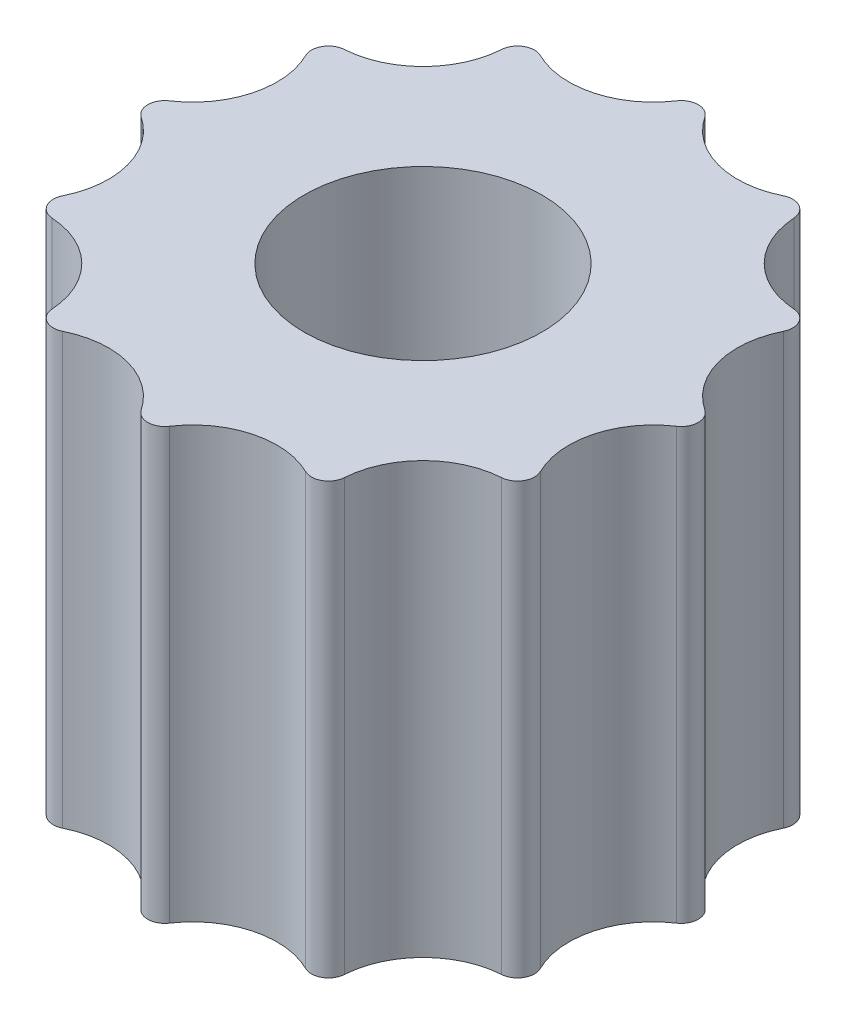
ISO-10303-21;
HEADER;
FILE_DESCRIPTION(('STEP AP214'),'2;1');
FILE_NAME('part.step','',(''),(''),'','','');
FILE_SCHEMA(('AUTOMOTIVE_DESIGN { 1 0 10303 214 1 1 1 1 }'));
ENDSEC;
DATA;
#1=APPLICATION_CONTEXT('core data for automotive mechanical design processes');
#2=APPLICATION_PROTOCOL_DEFINITION('international standard','automotive_design',2000,#1);
#3=PRODUCT_CONTEXT('',#1,'mechanical');
#4=PRODUCT('Part','Part','',(#3));
#5=PRODUCT_RELATED_PRODUCT_CATEGORY('part','',(#4));
#6=PRODUCT_DEFINITION_FORMATION('','',#4);
#7=PRODUCT_DEFINITION_CONTEXT('part definition',#1,'design');
#8=PRODUCT_DEFINITION('design','',#6,#7);
#9=PRODUCT_DEFINITION_SHAPE('','',#8);
#10=(LENGTH_UNIT() NAMED_UNIT(*) SI_UNIT(.MILLI.,.METRE.));
#11=(NAMED_UNIT(*) PLANE_ANGLE_UNIT() SI_UNIT($,.RADIAN.));
#12=(NAMED_UNIT(*) SI_UNIT($,.STERADIAN.) SOLID_ANGLE_UNIT());
#13=UNCERTAINTY_MEASURE_WITH_UNIT(LENGTH_MEASURE(1.E-05),#10,'distance_accuracy_value','');
#14=(GEOMETRIC_REPRESENTATION_CONTEXT(3) GLOBAL_UNCERTAINTY_ASSIGNED_CONTEXT((#13)) GLOBAL_UNIT_ASSIGNED_CONTEXT((#10,
#11,#12)) REPRESENTATION_CONTEXT('',''));
#15=CARTESIAN_POINT('',(0.,0.,0.));
#16=DIRECTION('',(0.,0.,1.));
#17=DIRECTION('',(1.,0.,0.));
#18=AXIS2_PLACEMENT_3D('',#15,#16,#17);
#19=CARTESIAN_POINT('',(-2.77703675058107,7.6,-4.80996874649239));
#20=DIRECTION('',(0.,1.,0.));
#21=DIRECTION('',(0.,0.,1.));
#22=AXIS2_PLACEMENT_3D('',#19,#20,#21);
#23=PLANE('',#22);
#24=CARTESIAN_POINT('',(5.55407350116214,7.6,-1.4882095093395));
#25=DIRECTION('',(0.,-1.,0.));
#26=DIRECTION('',(0.,0.,1.));
#27=AXIS2_PLACEMENT_3D('',#24,#25,#26);
#28=CIRCLE('',#27,1.48919155491039);
#29=CARTESIAN_POINT('',(4.72740990112526,7.6,-0.249533288694861));
#30=VERTEX_POINT('',#29);
#31=CARTESIAN_POINT('',(4.21882371282398,7.6,-2.14760278346301));
#32=VERTEX_POINT('',#31);
#33=EDGE_CURVE('E448',#30,#32,#28,.T.);
#34=ORIENTED_EDGE('',*,*,#33,.T.);
#35=CARTESIAN_POINT('',(3.94983552579015,7.6,-2.28043860406969));
#36=DIRECTION('',(0.,1.,0.));
#37=DIRECTION('',(0.,0.,1.));
#38=AXIS2_PLACEMENT_3D('',#35,#36,#37);
#39=CIRCLE('',#38,0.3);
#40=CARTESIAN_POINT('',(3.96929042412913,7.6,-2.57980711766225));
#41=VERTEX_POINT('',#40);
#42=EDGE_CURVE('E318',#32,#41,#39,.T.);
#43=ORIENTED_EDGE('',*,*,#42,.T.);
#44=CARTESIAN_POINT('',(4.06586399182265,7.6,-4.06586399182265));
#45=DIRECTION('',(0.,-1.,0.));
#46=DIRECTION('',(0.,0.,1.));
#47=AXIS2_PLACEMENT_3D('',#44,#45,#46);
#48=CIRCLE('',#47,1.48919155491039);
#49=CARTESIAN_POINT('',(2.57980711766224,7.6,-3.96929042412914));
#50=VERTEX_POINT('',#49);
#51=EDGE_CURVE('E223',#41,#50,#48,.T.);
#52=ORIENTED_EDGE('',*,*,#51,.T.);
#53=CARTESIAN_POINT('',(2.28043860406968,7.6,-3.94983552579015));
#54=DIRECTION('',(0.,1.,0.));
#55=DIRECTION('',(0.,0.,1.));
#56=AXIS2_PLACEMENT_3D('',#53,#54,#55);
#57=CIRCLE('',#56,0.3);
#58=CARTESIAN_POINT('',(2.14760278346301,7.6,-4.21882371282399));
#59=VERTEX_POINT('',#58);
#60=EDGE_CURVE('E286',#50,#59,#57,.T.);
#61=ORIENTED_EDGE('',*,*,#60,.T.);
#62=CARTESIAN_POINT('',(1.48820950933949,7.6,-5.55407350116214));
#63=DIRECTION('',(0.,-1.,0.));
#64=DIRECTION('',(0.,0.,1.));
#65=AXIS2_PLACEMENT_3D('',#62,#63,#64);
#66=CIRCLE('',#65,1.48919155491039);
#67=CARTESIAN_POINT('',(0.249533288694854,7.6,-4.72740990112526));
#68=VERTEX_POINT('',#67);
#69=EDGE_CURVE('E389',#59,#68,#66,.T.);
#70=ORIENTED_EDGE('',*,*,#69,.T.);
#71=CARTESIAN_POINT('',(0.,7.6,-4.56087720813937));
#72=DIRECTION('',(0.,1.,0.));
#73=DIRECTION('',(0.,0.,1.));
#74=AXIS2_PLACEMENT_3D('',#71,#72,#73);
#75=CIRCLE('',#74,0.3);
#76=CARTESIAN_POINT('',(-0.249533288694852,7.6,-4.72740990112526));
#77=VERTEX_POINT('',#76);
#78=EDGE_CURVE('E62',#68,#77,#75,.T.);
#79=ORIENTED_EDGE('',*,*,#78,.T.);
#80=CARTESIAN_POINT('',(-1.4882095093395,7.6,-5.55407350116214));
#81=DIRECTION('',(0.,-1.,0.));
#82=DIRECTION('',(0.,0.,1.));
#83=AXIS2_PLACEMENT_3D('',#80,#81,#82);
#84=CIRCLE('',#83,1.48919155491039);
#85=CARTESIAN_POINT('',(-2.14760278346302,7.6,-4.21882371282398));
#86=VERTEX_POINT('',#85);
#87=EDGE_CURVE('E248',#77,#86,#84,.T.);
#88=ORIENTED_EDGE('',*,*,#87,.T.);
#89=CARTESIAN_POINT('',(-2.28043860406969,7.6,-3.94983552579014));
#90=DIRECTION('',(0.,1.,0.));
#91=DIRECTION('',(0.,0.,1.));
#92=AXIS2_PLACEMENT_3D('',#89,#90,#91);
#93=CIRCLE('',#92,0.3);
#94=CARTESIAN_POINT('',(-2.57980711766225,7.6,-3.96929042412913));
#95=VERTEX_POINT('',#94);
#96=EDGE_CURVE('E291',#86,#95,#93,.T.);
#97=ORIENTED_EDGE('',*,*,#96,.T.);
#98=CARTESIAN_POINT('',(-4.06586399182265,7.6,-4.06586399182265));
#99=DIRECTION('',(0.,-1.,0.));
#100=DIRECTION('',(0.,0.,1.));
#101=AXIS2_PLACEMENT_3D('',#98,#99,#100);
#102=CIRCLE('',#101,1.48919155491039);
#103=CARTESIAN_POINT('',(-3.96929042412913,7.6,-2.57980711766225));
#104=VERTEX_POINT('',#103);
#105=EDGE_CURVE('E246',#95,#104,#102,.T.);
#106=ORIENTED_EDGE('',*,*,#105,.T.);
#107=CARTESIAN_POINT('',(-3.94983552579014,7.6,-2.28043860406969));
#108=DIRECTION('',(0.,1.,0.));
#109=DIRECTION('',(0.,0.,1.));
#110=AXIS2_PLACEMENT_3D('',#107,#108,#109);
#111=CIRCLE('',#110,0.3);
#112=CARTESIAN_POINT('',(-4.21882371282398,7.6,-2.14760278346301));
#113=VERTEX_POINT('',#112);
#114=EDGE_CURVE('E294',#104,#113,#111,.T.);
#115=ORIENTED_EDGE('',*,*,#114,.T.);
#116=CARTESIAN_POINT('',(-5.55407350116215,7.6,-1.48820950933949));
#117=DIRECTION('',(0.,-1.,0.));
#118=DIRECTION('',(0.,0.,1.));
#119=AXIS2_PLACEMENT_3D('',#116,#117,#118);
#120=CIRCLE('',#119,1.4891915549104);
#121=CARTESIAN_POINT('',(-4.72740990112526,7.6,-0.249533288694845));
#122=VERTEX_POINT('',#121);
#123=EDGE_CURVE('E478',#113,#122,#120,.T.);
#124=ORIENTED_EDGE('',*,*,#123,.T.);
#125=CARTESIAN_POINT('',(-4.56087720813938,7.6,0.));
#126=DIRECTION('',(0.,1.,0.));
#127=DIRECTION('',(0.,0.,1.));
#128=AXIS2_PLACEMENT_3D('',#125,#126,#127);
#129=CIRCLE('',#128,0.3);
#130=CARTESIAN_POINT('',(-4.72740990112526,7.6,0.249533288694862));
#131=VERTEX_POINT('',#130);
#132=EDGE_CURVE('E297',#122,#131,#129,.T.);
#133=ORIENTED_EDGE('',*,*,#132,.T.);
#134=CARTESIAN_POINT('',(-5.55407350116214,7.6,1.4882095093395));
#135=DIRECTION('',(0.,-1.,0.));
#136=DIRECTION('',(0.,0.,1.));
#137=AXIS2_PLACEMENT_3D('',#134,#135,#136);
#138=CIRCLE('',#137,1.48919155491039);
#139=CARTESIAN_POINT('',(-4.21882371282398,7.6,2.14760278346301));
#140=VERTEX_POINT('',#139);
#141=EDGE_CURVE('E474',#131,#140,#138,.T.);
#142=ORIENTED_EDGE('',*,*,#141,.T.);
#143=CARTESIAN_POINT('',(-3.94983552579014,7.6,2.28043860406969));
#144=DIRECTION('',(0.,1.,0.));
#145=DIRECTION('',(0.,0.,1.));
#146=AXIS2_PLACEMENT_3D('',#143,#144,#145);
#147=CIRCLE('',#146,0.3);
#148=CARTESIAN_POINT('',(-3.96929042412913,7.6,2.57980711766225));
#149=VERTEX_POINT('',#148);
#150=EDGE_CURVE('E300',#140,#149,#147,.T.);
#151=ORIENTED_EDGE('',*,*,#150,.T.);
#152=CARTESIAN_POINT('',(-4.06586399182265,7.6,4.06586399182265));
#153=DIRECTION('',(0.,-1.,0.));
#154=DIRECTION('',(0.,0.,1.));
#155=AXIS2_PLACEMENT_3D('',#152,#153,#154);
#156=CIRCLE('',#155,1.48919155491039);
#157=CARTESIAN_POINT('',(-2.57980711766224,7.6,3.96929042412913));
#158=VERTEX_POINT('',#157);
#159=EDGE_CURVE('E470',#149,#158,#156,.T.);
#160=ORIENTED_EDGE('',*,*,#159,.T.);
#161=CARTESIAN_POINT('',(-2.28043860406968,7.6,3.94983552579015));
#162=DIRECTION('',(0.,1.,0.));
#163=DIRECTION('',(0.,0.,1.));
#164=AXIS2_PLACEMENT_3D('',#161,#162,#163);
#165=CIRCLE('',#164,0.3);
#166=CARTESIAN_POINT('',(-2.14760278346301,7.6,4.21882371282399));
#167=VERTEX_POINT('',#166);
#168=EDGE_CURVE('E303',#158,#167,#165,.T.);
#169=ORIENTED_EDGE('',*,*,#168,.T.);
#170=CARTESIAN_POINT('',(-1.48820950933949,7.6,5.55407350116214));
#171=DIRECTION('',(0.,-1.,0.));
#172=DIRECTION('',(0.,0.,1.));
#173=AXIS2_PLACEMENT_3D('',#170,#171,#172);
#174=CIRCLE('',#173,1.48919155491039);
#175=CARTESIAN_POINT('',(-0.249533288694853,7.6,4.72740990112526));
#176=VERTEX_POINT('',#175);
#177=EDGE_CURVE('E466',#167,#176,#174,.T.);
#178=ORIENTED_EDGE('',*,*,#177,.T.);
#179=CARTESIAN_POINT('',(0.,7.6,4.56087720813937));
#180=DIRECTION('',(0.,1.,0.));
#181=DIRECTION('',(0.,0.,1.));
#182=AXIS2_PLACEMENT_3D('',#179,#180,#181);
#183=CIRCLE('',#182,0.3);
#184=CARTESIAN_POINT('',(0.249533288694854,7.6,4.72740990112526));
#185=VERTEX_POINT('',#184);
#186=EDGE_CURVE('E306',#176,#185,#183,.T.);
#187=ORIENTED_EDGE('',*,*,#186,.T.);
#188=CARTESIAN_POINT('',(1.4882095093395,7.6,5.55407350116214));
#189=DIRECTION('',(0.,-1.,0.));
#190=DIRECTION('',(0.,0.,1.));
#191=AXIS2_PLACEMENT_3D('',#188,#189,#190);
#192=CIRCLE('',#191,1.48919155491039);
#193=CARTESIAN_POINT('',(2.14760278346302,7.6,4.21882371282398));
#194=VERTEX_POINT('',#193);
#195=EDGE_CURVE('E462',#185,#194,#192,.T.);
#196=ORIENTED_EDGE('',*,*,#195,.T.);
#197=CARTESIAN_POINT('',(2.28043860406969,7.6,3.94983552579014));
#198=DIRECTION('',(0.,1.,0.));
#199=DIRECTION('',(0.,0.,1.));
#200=AXIS2_PLACEMENT_3D('',#197,#198,#199);
#201=CIRCLE('',#200,0.3);
#202=CARTESIAN_POINT('',(2.57980711766225,7.6,3.96929042412913));
#203=VERTEX_POINT('',#202);
#204=EDGE_CURVE('E309',#194,#203,#201,.T.);
#205=ORIENTED_EDGE('',*,*,#204,.T.);
#206=CARTESIAN_POINT('',(4.06586399182265,7.6,4.06586399182264));
#207=DIRECTION('',(0.,-1.,0.));
#208=DIRECTION('',(0.,0.,1.));
#209=AXIS2_PLACEMENT_3D('',#206,#207,#208);
#210=CIRCLE('',#209,1.48919155491039);
#211=CARTESIAN_POINT('',(3.96929042412913,7.6,2.57980711766225));
#212=VERTEX_POINT('',#211);
#213=EDGE_CURVE('E456',#203,#212,#210,.T.);
#214=ORIENTED_EDGE('',*,*,#213,.T.);
#215=CARTESIAN_POINT('',(3.94983552579014,7.6,2.28043860406969));
#216=DIRECTION('',(0.,1.,0.));
#217=DIRECTION('',(0.,0.,1.));
#218=AXIS2_PLACEMENT_3D('',#215,#216,#217);
#219=CIRCLE('',#218,0.3);
#220=CARTESIAN_POINT('',(4.21882371282398,7.6,2.14760278346301));
#221=VERTEX_POINT('',#220);
#222=EDGE_CURVE('E312',#212,#221,#219,.T.);
#223=ORIENTED_EDGE('',*,*,#222,.T.);
#224=CARTESIAN_POINT('',(5.55407350116214,7.6,1.48820950933949));
#225=DIRECTION('',(0.,-1.,0.));
#226=DIRECTION('',(0.,0.,1.));
#227=AXIS2_PLACEMENT_3D('',#224,#225,#226);
#228=CIRCLE('',#227,1.48919155491039);
#229=CARTESIAN_POINT('',(4.72740990112526,7.6,0.249533288694847));
#230=VERTEX_POINT('',#229);
#231=EDGE_CURVE('E449',#221,#230,#228,.T.);
#232=ORIENTED_EDGE('',*,*,#231,.T.);
#233=CARTESIAN_POINT('',(4.56087720813938,7.6,0.));
#234=DIRECTION('',(0.,1.,0.));
#235=DIRECTION('',(0.,0.,1.));
#236=AXIS2_PLACEMENT_3D('',#233,#234,#235);
#237=CIRCLE('',#236,0.3);
#238=EDGE_CURVE('E315',#230,#30,#237,.T.);
#239=ORIENTED_EDGE('',*,*,#238,.T.);
#240=EDGE_LOOP('',(#34,#43,#52,#61,#70,#79,#88,#97,#106,#115,#124,#133,#142,#151,#160,#169,#178,
#187,#196,#205,#214,#223,#232,#239));
#241=FACE_BOUND('',#240,.T.);
#242=CARTESIAN_POINT('',(0.,7.6,0.));
#243=DIRECTION('',(0.,1.,0.));
#244=DIRECTION('',(0.,0.,1.));
#245=AXIS2_PLACEMENT_3D('',#242,#243,#244);
#246=CIRCLE('',#245,2.1);
#247=CARTESIAN_POINT('',(0.,7.6,2.1));
#248=VERTEX_POINT('',#247);
#249=EDGE_CURVE('E409',#248,#248,#246,.T.);
#250=ORIENTED_EDGE('',*,*,#249,.F.);
#251=EDGE_LOOP('',(#250));
#252=FACE_BOUND('',#251,.T.);
#253=ADVANCED_FACE('F39',(#241,#252),#23,.T.);
#254=CARTESIAN_POINT('',(-2.77703675058107,0.,-4.80996874649239));
#255=DIRECTION('',(0.,1.,0.));
#256=DIRECTION('',(0.,0.,1.));
#257=AXIS2_PLACEMENT_3D('',#254,#255,#256);
#258=PLANE('',#257);
#259=CARTESIAN_POINT('',(4.06586399182265,0.,-4.06586399182265));
#260=DIRECTION('',(0.,-1.,0.));
#261=DIRECTION('',(0.,0.,1.));
#262=AXIS2_PLACEMENT_3D('',#259,#260,#261);
#263=CIRCLE('',#262,1.48919155491039);
#264=CARTESIAN_POINT('',(3.96929042412913,0.,-2.57980711766225));
#265=VERTEX_POINT('',#264);
#266=CARTESIAN_POINT('',(2.57980711766224,0.,-3.96929042412914));
#267=VERTEX_POINT('',#266);
#268=EDGE_CURVE('E220',#265,#267,#263,.T.);
#269=ORIENTED_EDGE('',*,*,#268,.F.);
#270=CARTESIAN_POINT('',(3.94983552579015,0.,-2.28043860406969));
#271=DIRECTION('',(0.,1.,0.));
#272=DIRECTION('',(0.,0.,1.));
#273=AXIS2_PLACEMENT_3D('',#270,#271,#272);
#274=CIRCLE('',#273,0.3);
#275=CARTESIAN_POINT('',(4.21882371282398,0.,-2.14760278346301));
#276=VERTEX_POINT('',#275);
#277=EDGE_CURVE('E202',#265,#276,#274,.F.);
#278=ORIENTED_EDGE('',*,*,#277,.T.);
#279=CARTESIAN_POINT('',(5.55407350116214,0.,-1.4882095093395));
#280=DIRECTION('',(0.,-1.,0.));
#281=DIRECTION('',(0.,0.,1.));
#282=AXIS2_PLACEMENT_3D('',#279,#280,#281);
#283=CIRCLE('',#282,1.48919155491039);
#284=CARTESIAN_POINT('',(4.72740990112526,0.,-0.249533288694861));
#285=VERTEX_POINT('',#284);
#286=EDGE_CURVE('E233',#285,#276,#283,.T.);
#287=ORIENTED_EDGE('',*,*,#286,.F.);
#288=CARTESIAN_POINT('',(4.56087720813938,0.,0.));
#289=DIRECTION('',(0.,1.,0.));
#290=DIRECTION('',(0.,0.,1.));
#291=AXIS2_PLACEMENT_3D('',#288,#289,#290);
#292=CIRCLE('',#291,0.3);
#293=CARTESIAN_POINT('',(4.72740990112526,0.,0.249533288694847));
#294=VERTEX_POINT('',#293);
#295=EDGE_CURVE('E214',#285,#294,#292,.F.);
#296=ORIENTED_EDGE('',*,*,#295,.T.);
#297=CARTESIAN_POINT('',(5.55407350116214,0.,1.48820950933949));
#298=DIRECTION('',(0.,-1.,0.));
#299=DIRECTION('',(0.,0.,1.));
#300=AXIS2_PLACEMENT_3D('',#297,#298,#299);
#301=CIRCLE('',#300,1.48919155491039);
#302=CARTESIAN_POINT('',(4.21882371282398,0.,2.14760278346301));
#303=VERTEX_POINT('',#302);
#304=EDGE_CURVE('E240',#303,#294,#301,.T.);
#305=ORIENTED_EDGE('',*,*,#304,.F.);
#306=CARTESIAN_POINT('',(3.94983552579014,0.,2.28043860406969));
#307=DIRECTION('',(0.,1.,0.));
#308=DIRECTION('',(0.,0.,1.));
#309=AXIS2_PLACEMENT_3D('',#306,#307,#308);
#310=CIRCLE('',#309,0.3);
#311=CARTESIAN_POINT('',(3.96929042412913,0.,2.57980711766225));
#312=VERTEX_POINT('',#311);
#313=EDGE_CURVE('E276',#303,#312,#310,.F.);
#314=ORIENTED_EDGE('',*,*,#313,.T.);
#315=CARTESIAN_POINT('',(4.06586399182265,0.,4.06586399182264));
#316=DIRECTION('',(0.,-1.,0.));
#317=DIRECTION('',(0.,0.,1.));
#318=AXIS2_PLACEMENT_3D('',#315,#316,#317);
#319=CIRCLE('',#318,1.48919155491039);
#320=CARTESIAN_POINT('',(2.57980711766225,0.,3.96929042412913));
#321=VERTEX_POINT('',#320);
#322=EDGE_CURVE('E429',#321,#312,#319,.T.);
#323=ORIENTED_EDGE('',*,*,#322,.F.);
#324=CARTESIAN_POINT('',(2.28043860406969,0.,3.94983552579014));
#325=DIRECTION('',(0.,1.,0.));
#326=DIRECTION('',(0.,0.,1.));
#327=AXIS2_PLACEMENT_3D('',#324,#325,#326);
#328=CIRCLE('',#327,0.3);
#329=CARTESIAN_POINT('',(2.14760278346302,0.,4.21882371282398));
#330=VERTEX_POINT('',#329);
#331=EDGE_CURVE('E273',#321,#330,#328,.F.);
#332=ORIENTED_EDGE('',*,*,#331,.T.);
#333=CARTESIAN_POINT('',(1.4882095093395,0.,5.55407350116214));
#334=DIRECTION('',(0.,-1.,0.));
#335=DIRECTION('',(0.,0.,1.));
#336=AXIS2_PLACEMENT_3D('',#333,#334,#335);
#337=CIRCLE('',#336,1.48919155491039);
#338=CARTESIAN_POINT('',(0.249533288694854,0.,4.72740990112526));
#339=VERTEX_POINT('',#338);
#340=EDGE_CURVE('E425',#339,#330,#337,.T.);
#341=ORIENTED_EDGE('',*,*,#340,.F.);
#342=CARTESIAN_POINT('',(0.,0.,4.56087720813937));
#343=DIRECTION('',(0.,1.,0.));
#344=DIRECTION('',(0.,0.,1.));
#345=AXIS2_PLACEMENT_3D('',#342,#343,#344);
#346=CIRCLE('',#345,0.3);
#347=CARTESIAN_POINT('',(-0.249533288694853,0.,4.72740990112526));
#348=VERTEX_POINT('',#347);
#349=EDGE_CURVE('E270',#339,#348,#346,.F.);
#350=ORIENTED_EDGE('',*,*,#349,.T.);
#351=CARTESIAN_POINT('',(-1.48820950933949,0.,5.55407350116214));
#352=DIRECTION('',(0.,-1.,0.));
#353=DIRECTION('',(0.,0.,1.));
#354=AXIS2_PLACEMENT_3D('',#351,#352,#353);
#355=CIRCLE('',#354,1.48919155491039);
#356=CARTESIAN_POINT('',(-2.14760278346301,0.,4.21882371282399));
#357=VERTEX_POINT('',#356);
#358=EDGE_CURVE('E421',#357,#348,#355,.T.);
#359=ORIENTED_EDGE('',*,*,#358,.F.);
#360=CARTESIAN_POINT('',(-2.28043860406968,0.,3.94983552579015));
#361=DIRECTION('',(0.,1.,0.));
#362=DIRECTION('',(0.,0.,1.));
#363=AXIS2_PLACEMENT_3D('',#360,#361,#362);
#364=CIRCLE('',#363,0.3);
#365=CARTESIAN_POINT('',(-2.57980711766224,0.,3.96929042412913));
#366=VERTEX_POINT('',#365);
#367=EDGE_CURVE('E267',#357,#366,#364,.F.);
#368=ORIENTED_EDGE('',*,*,#367,.T.);
#369=CARTESIAN_POINT('',(-4.06586399182265,0.,4.06586399182265));
#370=DIRECTION('',(0.,-1.,0.));
#371=DIRECTION('',(0.,0.,1.));
#372=AXIS2_PLACEMENT_3D('',#369,#370,#371);
#373=CIRCLE('',#372,1.48919155491039);
#374=CARTESIAN_POINT('',(-3.96929042412913,0.,2.57980711766225));
#375=VERTEX_POINT('',#374);
#376=EDGE_CURVE('E417',#375,#366,#373,.T.);
#377=ORIENTED_EDGE('',*,*,#376,.F.);
#378=CARTESIAN_POINT('',(-3.94983552579014,0.,2.28043860406969));
#379=DIRECTION('',(0.,1.,0.));
#380=DIRECTION('',(0.,0.,1.));
#381=AXIS2_PLACEMENT_3D('',#378,#379,#380);
#382=CIRCLE('',#381,0.3);
#383=CARTESIAN_POINT('',(-4.21882371282398,0.,2.14760278346301));
#384=VERTEX_POINT('',#383);
#385=EDGE_CURVE('E264',#375,#384,#382,.F.);
#386=ORIENTED_EDGE('',*,*,#385,.T.);
#387=CARTESIAN_POINT('',(-5.55407350116214,0.,1.4882095093395));
#388=DIRECTION('',(0.,-1.,0.));
#389=DIRECTION('',(0.,0.,1.));
#390=AXIS2_PLACEMENT_3D('',#387,#388,#389);
#391=CIRCLE('',#390,1.48919155491039);
#392=CARTESIAN_POINT('',(-4.72740990112526,0.,0.249533288694862));
#393=VERTEX_POINT('',#392);
#394=EDGE_CURVE('E413',#393,#384,#391,.T.);
#395=ORIENTED_EDGE('',*,*,#394,.F.);
#396=CARTESIAN_POINT('',(-4.56087720813938,0.,0.));
#397=DIRECTION('',(0.,1.,0.));
#398=DIRECTION('',(0.,0.,1.));
#399=AXIS2_PLACEMENT_3D('',#396,#397,#398);
#400=CIRCLE('',#399,0.3);
#401=CARTESIAN_POINT('',(-4.72740990112526,0.,-0.249533288694845));
#402=VERTEX_POINT('',#401);
#403=EDGE_CURVE('E261',#393,#402,#400,.F.);
#404=ORIENTED_EDGE('',*,*,#403,.T.);
#405=CARTESIAN_POINT('',(-5.55407350116215,0.,-1.48820950933949));
#406=DIRECTION('',(0.,-1.,0.));
#407=DIRECTION('',(0.,0.,1.));
#408=AXIS2_PLACEMENT_3D('',#405,#406,#407);
#409=CIRCLE('',#408,1.4891915549104);
#410=CARTESIAN_POINT('',(-4.21882371282398,0.,-2.14760278346301));
#411=VERTEX_POINT('',#410);
#412=EDGE_CURVE('E408',#411,#402,#409,.T.);
#413=ORIENTED_EDGE('',*,*,#412,.F.);
#414=CARTESIAN_POINT('',(-3.94983552579014,0.,-2.28043860406969));
#415=DIRECTION('',(0.,1.,0.));
#416=DIRECTION('',(0.,0.,1.));
#417=AXIS2_PLACEMENT_3D('',#414,#415,#416);
#418=CIRCLE('',#417,0.3);
#419=CARTESIAN_POINT('',(-3.96929042412913,0.,-2.57980711766225));
#420=VERTEX_POINT('',#419);
#421=EDGE_CURVE('E258',#411,#420,#418,.F.);
#422=ORIENTED_EDGE('',*,*,#421,.T.);
#423=CARTESIAN_POINT('',(-4.06586399182265,0.,-4.06586399182265));
#424=DIRECTION('',(0.,-1.,0.));
#425=DIRECTION('',(0.,0.,1.));
#426=AXIS2_PLACEMENT_3D('',#423,#424,#425);
#427=CIRCLE('',#426,1.48919155491039);
#428=CARTESIAN_POINT('',(-2.57980711766225,0.,-3.96929042412913));
#429=VERTEX_POINT('',#428);
#430=EDGE_CURVE('E404',#429,#420,#427,.T.);
#431=ORIENTED_EDGE('',*,*,#430,.F.);
#432=CARTESIAN_POINT('',(-2.28043860406969,0.,-3.94983552579014));
#433=DIRECTION('',(0.,1.,0.));
#434=DIRECTION('',(0.,0.,1.));
#435=AXIS2_PLACEMENT_3D('',#432,#433,#434);
#436=CIRCLE('',#435,0.3);
#437=CARTESIAN_POINT('',(-2.14760278346302,0.,-4.21882371282398));
#438=VERTEX_POINT('',#437);
#439=EDGE_CURVE('E255',#429,#438,#436,.F.);
#440=ORIENTED_EDGE('',*,*,#439,.T.);
#441=CARTESIAN_POINT('',(-1.4882095093395,0.,-5.55407350116214));
#442=DIRECTION('',(0.,-1.,0.));
#443=DIRECTION('',(0.,0.,1.));
#444=AXIS2_PLACEMENT_3D('',#441,#442,#443);
#445=CIRCLE('',#444,1.48919155491039);
#446=CARTESIAN_POINT('',(-0.249533288694852,0.,-4.72740990112526));
#447=VERTEX_POINT('',#446);
#448=EDGE_CURVE('E238',#447,#438,#445,.T.);
#449=ORIENTED_EDGE('',*,*,#448,.F.);
#450=CARTESIAN_POINT('',(0.,0.,-4.56087720813937));
#451=DIRECTION('',(0.,1.,0.));
#452=DIRECTION('',(0.,0.,1.));
#453=AXIS2_PLACEMENT_3D('',#450,#451,#452);
#454=CIRCLE('',#453,0.3);
#455=CARTESIAN_POINT('',(0.249533288694854,0.,-4.72740990112526));
#456=VERTEX_POINT('',#455);
#457=EDGE_CURVE('E252',#447,#456,#454,.F.);
#458=ORIENTED_EDGE('',*,*,#457,.T.);
#459=CARTESIAN_POINT('',(1.48820950933949,0.,-5.55407350116214));
#460=DIRECTION('',(0.,-1.,0.));
#461=DIRECTION('',(0.,0.,1.));
#462=AXIS2_PLACEMENT_3D('',#459,#460,#461);
#463=CIRCLE('',#462,1.48919155491039);
#464=CARTESIAN_POINT('',(2.14760278346301,0.,-4.21882371282399));
#465=VERTEX_POINT('',#464);
#466=EDGE_CURVE('E232',#465,#456,#463,.T.);
#467=ORIENTED_EDGE('',*,*,#466,.F.);
#468=CARTESIAN_POINT('',(2.28043860406968,0.,-3.94983552579015));
#469=DIRECTION('',(0.,1.,0.));
#470=DIRECTION('',(0.,0.,1.));
#471=AXIS2_PLACEMENT_3D('',#468,#469,#470);
#472=CIRCLE('',#471,0.3);
#473=EDGE_CURVE('E225',#465,#267,#472,.F.);
#474=ORIENTED_EDGE('',*,*,#473,.T.);
#475=EDGE_LOOP('',(#269,#278,#287,#296,#305,#314,#323,#332,#341,#350,#359,#368,#377,#386,#395,
#404,#413,#422,#431,#440,#449,#458,#467,#474));
#476=FACE_BOUND('',#475,.T.);
#477=CARTESIAN_POINT('',(0.,0.,0.));
#478=DIRECTION('',(0.,1.,0.));
#479=DIRECTION('',(0.,0.,1.));
#480=AXIS2_PLACEMENT_3D('',#477,#478,#479);
#481=CIRCLE('',#480,2.1);
#482=CARTESIAN_POINT('',(0.,0.,2.1));
#483=VERTEX_POINT('',#482);
#484=EDGE_CURVE('E485',#483,#483,#481,.T.);
#485=ORIENTED_EDGE('',*,*,#484,.T.);
#486=EDGE_LOOP('',(#485));
#487=FACE_BOUND('',#486,.T.);
#488=ADVANCED_FACE('F228',(#476,#487),#258,.F.);
#489=CARTESIAN_POINT('',(-4.06586399182265,7.6,-4.06586399182265));
#490=DIRECTION('',(0.,-1.,0.));
#491=DIRECTION('',(0.,0.,-1.));
#492=AXIS2_PLACEMENT_3D('',#489,#490,#491);
#493=CYLINDRICAL_SURFACE('',#492,1.48919155491039);
#494=ORIENTED_EDGE('',*,*,#430,.T.);
#495=DIRECTION('',(0.,-1.,0.));
#496=VECTOR('',#495,1.);
#497=CARTESIAN_POINT('',(-3.96929042412913,7.6,-2.57980711766225));
#498=LINE('',#497,#496);
#499=EDGE_CURVE('E374',#420,#104,#498,.F.);
#500=ORIENTED_EDGE('',*,*,#499,.T.);
#501=ORIENTED_EDGE('',*,*,#105,.F.);
#502=DIRECTION('',(0.,-1.,0.));
#503=VECTOR('',#502,1.);
#504=CARTESIAN_POINT('',(-2.57980711766225,7.6,-3.96929042412913));
#505=LINE('',#504,#503);
#506=EDGE_CURVE('E370',#95,#429,#505,.T.);
#507=ORIENTED_EDGE('',*,*,#506,.T.);
#508=EDGE_LOOP('',(#494,#500,#501,#507));
#509=FACE_BOUND('',#508,.T.);
#510=ADVANCED_FACE('F500',(#509),#493,.F.);
#511=CARTESIAN_POINT('',(-5.55407350116215,7.6,-1.48820950933949));
#512=DIRECTION('',(0.,-1.,0.));
#513=DIRECTION('',(0.,0.,-1.));
#514=AXIS2_PLACEMENT_3D('',#511,#512,#513);
#515=CYLINDRICAL_SURFACE('',#514,1.4891915549104);
#516=ORIENTED_EDGE('',*,*,#412,.T.);
#517=DIRECTION('',(0.,-1.,0.));
#518=VECTOR('',#517,1.);
#519=CARTESIAN_POINT('',(-4.72740990112526,7.6,-0.249533288694845));
#520=LINE('',#519,#518);
#521=EDGE_CURVE('E367',#402,#122,#520,.F.);
#522=ORIENTED_EDGE('',*,*,#521,.T.);
#523=ORIENTED_EDGE('',*,*,#123,.F.);
#524=DIRECTION('',(0.,-1.,0.));
#525=VECTOR('',#524,1.);
#526=CARTESIAN_POINT('',(-4.21882371282398,7.6,-2.14760278346301));
#527=LINE('',#526,#525);
#528=EDGE_CURVE('E363',#113,#411,#527,.T.);
#529=ORIENTED_EDGE('',*,*,#528,.T.);
#530=EDGE_LOOP('',(#516,#522,#523,#529));
#531=FACE_BOUND('',#530,.T.);
#532=ADVANCED_FACE('F533',(#531),#515,.F.);
#533=CARTESIAN_POINT('',(-5.55407350116214,7.6,1.4882095093395));
#534=DIRECTION('',(0.,-1.,0.));
#535=DIRECTION('',(0.,0.,-1.));
#536=AXIS2_PLACEMENT_3D('',#533,#534,#535);
#537=CYLINDRICAL_SURFACE('',#536,1.48919155491039);
#538=ORIENTED_EDGE('',*,*,#394,.T.);
#539=DIRECTION('',(0.,-1.,0.));
#540=VECTOR('',#539,1.);
#541=CARTESIAN_POINT('',(-4.21882371282398,7.6,2.14760278346301));
#542=LINE('',#541,#540);
#543=EDGE_CURVE('E360',#384,#140,#542,.F.);
#544=ORIENTED_EDGE('',*,*,#543,.T.);
#545=ORIENTED_EDGE('',*,*,#141,.F.);
#546=DIRECTION('',(0.,-1.,0.));
#547=VECTOR('',#546,1.);
#548=CARTESIAN_POINT('',(-4.72740990112526,7.6,0.249533288694862));
#549=LINE('',#548,#547);
#550=EDGE_CURVE('E356',#131,#393,#549,.T.);
#551=ORIENTED_EDGE('',*,*,#550,.T.);
#552=EDGE_LOOP('',(#538,#544,#545,#551));
#553=FACE_BOUND('',#552,.T.);
#554=ADVANCED_FACE('F529',(#553),#537,.F.);
#555=CARTESIAN_POINT('',(-4.06586399182265,7.6,4.06586399182265));
#556=DIRECTION('',(0.,-1.,0.));
#557=DIRECTION('',(0.,0.,-1.));
#558=AXIS2_PLACEMENT_3D('',#555,#556,#557);
#559=CYLINDRICAL_SURFACE('',#558,1.48919155491039);
#560=ORIENTED_EDGE('',*,*,#376,.T.);
#561=DIRECTION('',(0.,-1.,0.));
#562=VECTOR('',#561,1.);
#563=CARTESIAN_POINT('',(-2.57980711766224,7.6,3.96929042412913));
#564=LINE('',#563,#562);
#565=EDGE_CURVE('E353',#366,#158,#564,.F.);
#566=ORIENTED_EDGE('',*,*,#565,.T.);
#567=ORIENTED_EDGE('',*,*,#159,.F.);
#568=DIRECTION('',(0.,-1.,0.));
#569=VECTOR('',#568,1.);
#570=CARTESIAN_POINT('',(-3.96929042412913,7.6,2.57980711766225));
#571=LINE('',#570,#569);
#572=EDGE_CURVE('E349',#149,#375,#571,.T.);
#573=ORIENTED_EDGE('',*,*,#572,.T.);
#574=EDGE_LOOP('',(#560,#566,#567,#573));
#575=FACE_BOUND('',#574,.T.);
#576=ADVANCED_FACE('F525',(#575),#559,.F.);
#577=CARTESIAN_POINT('',(-1.48820950933949,7.6,5.55407350116214));
#578=DIRECTION('',(0.,-1.,0.));
#579=DIRECTION('',(0.,0.,-1.));
#580=AXIS2_PLACEMENT_3D('',#577,#578,#579);
#581=CYLINDRICAL_SURFACE('',#580,1.48919155491039);
#582=ORIENTED_EDGE('',*,*,#358,.T.);
#583=DIRECTION('',(0.,-1.,0.));
#584=VECTOR('',#583,1.);
#585=CARTESIAN_POINT('',(-0.249533288694853,7.6,4.72740990112526));
#586=LINE('',#585,#584);
#587=EDGE_CURVE('E346',#348,#176,#586,.F.);
#588=ORIENTED_EDGE('',*,*,#587,.T.);
#589=ORIENTED_EDGE('',*,*,#177,.F.);
#590=DIRECTION('',(0.,-1.,0.));
#591=VECTOR('',#590,1.);
#592=CARTESIAN_POINT('',(-2.14760278346301,7.6,4.21882371282399));
#593=LINE('',#592,#591);
#594=EDGE_CURVE('E342',#167,#357,#593,.T.);
#595=ORIENTED_EDGE('',*,*,#594,.T.);
#596=EDGE_LOOP('',(#582,#588,#589,#595));
#597=FACE_BOUND('',#596,.T.);
#598=ADVANCED_FACE('F521',(#597),#581,.F.);
#599=CARTESIAN_POINT('',(1.4882095093395,7.6,5.55407350116214));
#600=DIRECTION('',(0.,-1.,0.));
#601=DIRECTION('',(0.,0.,-1.));
#602=AXIS2_PLACEMENT_3D('',#599,#600,#601);
#603=CYLINDRICAL_SURFACE('',#602,1.48919155491039);
#604=ORIENTED_EDGE('',*,*,#340,.T.);
#605=DIRECTION('',(0.,-1.,0.));
#606=VECTOR('',#605,1.);
#607=CARTESIAN_POINT('',(2.14760278346302,7.6,4.21882371282398));
#608=LINE('',#607,#606);
#609=EDGE_CURVE('E339',#330,#194,#608,.F.);
#610=ORIENTED_EDGE('',*,*,#609,.T.);
#611=ORIENTED_EDGE('',*,*,#195,.F.);
#612=DIRECTION('',(0.,-1.,0.));
#613=VECTOR('',#612,1.);
#614=CARTESIAN_POINT('',(0.249533288694853,7.6,4.72740990112526));
#615=LINE('',#614,#613);
#616=EDGE_CURVE('E335',#185,#339,#615,.T.);
#617=ORIENTED_EDGE('',*,*,#616,.T.);
#618=EDGE_LOOP('',(#604,#610,#611,#617));
#619=FACE_BOUND('',#618,.T.);
#620=ADVANCED_FACE('F517',(#619),#603,.F.);
#621=CARTESIAN_POINT('',(4.06586399182265,7.6,4.06586399182264));
#622=DIRECTION('',(0.,-1.,0.));
#623=DIRECTION('',(0.,0.,-1.));
#624=AXIS2_PLACEMENT_3D('',#621,#622,#623);
#625=CYLINDRICAL_SURFACE('',#624,1.48919155491039);
#626=ORIENTED_EDGE('',*,*,#322,.T.);
#627=DIRECTION('',(0.,-1.,0.));
#628=VECTOR('',#627,1.);
#629=CARTESIAN_POINT('',(3.96929042412913,7.6,2.57980711766225));
#630=LINE('',#629,#628);
#631=EDGE_CURVE('E332',#312,#212,#630,.F.);
#632=ORIENTED_EDGE('',*,*,#631,.T.);
#633=ORIENTED_EDGE('',*,*,#213,.F.);
#634=DIRECTION('',(0.,-1.,0.));
#635=VECTOR('',#634,1.);
#636=CARTESIAN_POINT('',(2.57980711766225,7.6,3.96929042412913));
#637=LINE('',#636,#635);
#638=EDGE_CURVE('E328',#203,#321,#637,.T.);
#639=ORIENTED_EDGE('',*,*,#638,.T.);
#640=EDGE_LOOP('',(#626,#632,#633,#639));
#641=FACE_BOUND('',#640,.T.);
#642=ADVANCED_FACE('F514',(#641),#625,.F.);
#643=CARTESIAN_POINT('',(5.55407350116214,7.6,1.48820950933949));
#644=DIRECTION('',(0.,-1.,0.));
#645=DIRECTION('',(0.,0.,-1.));
#646=AXIS2_PLACEMENT_3D('',#643,#644,#645);
#647=CYLINDRICAL_SURFACE('',#646,1.48919155491039);
#648=ORIENTED_EDGE('',*,*,#304,.T.);
#649=DIRECTION('',(0.,-1.,0.));
#650=VECTOR('',#649,1.);
#651=CARTESIAN_POINT('',(4.72740990112526,7.6,0.249533288694847));
#652=LINE('',#651,#650);
#653=EDGE_CURVE('E325',#294,#230,#652,.F.);
#654=ORIENTED_EDGE('',*,*,#653,.T.);
#655=ORIENTED_EDGE('',*,*,#231,.F.);
#656=DIRECTION('',(0.,-1.,0.));
#657=VECTOR('',#656,1.);
#658=CARTESIAN_POINT('',(4.21882371282398,7.6,2.14760278346301));
#659=LINE('',#658,#657);
#660=EDGE_CURVE('E321',#221,#303,#659,.T.);
#661=ORIENTED_EDGE('',*,*,#660,.T.);
#662=EDGE_LOOP('',(#648,#654,#655,#661));
#663=FACE_BOUND('',#662,.T.);
#664=ADVANCED_FACE('F437',(#663),#647,.F.);
#665=CARTESIAN_POINT('',(5.55407350116214,7.6,-1.4882095093395));
#666=DIRECTION('',(0.,-1.,0.));
#667=DIRECTION('',(0.,0.,-1.));
#668=AXIS2_PLACEMENT_3D('',#665,#666,#667);
#669=CYLINDRICAL_SURFACE('',#668,1.48919155491039);
#670=ORIENTED_EDGE('',*,*,#286,.T.);
#671=DIRECTION('',(0.,-1.,0.));
#672=VECTOR('',#671,1.);
#673=CARTESIAN_POINT('',(4.21882371282398,7.6,-2.14760278346301));
#674=LINE('',#673,#672);
#675=EDGE_CURVE('E207',#276,#32,#674,.F.);
#676=ORIENTED_EDGE('',*,*,#675,.T.);
#677=ORIENTED_EDGE('',*,*,#33,.F.);
#678=DIRECTION('',(0.,-1.,0.));
#679=VECTOR('',#678,1.);
#680=CARTESIAN_POINT('',(4.72740990112526,7.6,-0.249533288694861));
#681=LINE('',#680,#679);
#682=EDGE_CURVE('E213',#30,#285,#681,.T.);
#683=ORIENTED_EDGE('',*,*,#682,.T.);
#684=EDGE_LOOP('',(#670,#676,#677,#683));
#685=FACE_BOUND('',#684,.T.);
#686=ADVANCED_FACE('F451',(#685),#669,.F.);
#687=CARTESIAN_POINT('',(4.06586399182265,7.6,-4.06586399182265));
#688=DIRECTION('',(0.,-1.,0.));
#689=DIRECTION('',(0.,0.,-1.));
#690=AXIS2_PLACEMENT_3D('',#687,#688,#689);
#691=CYLINDRICAL_SURFACE('',#690,1.48919155491039);
#692=ORIENTED_EDGE('',*,*,#51,.F.);
#693=DIRECTION('',(0.,-1.,0.));
#694=VECTOR('',#693,1.);
#695=CARTESIAN_POINT('',(3.96929042412913,7.6,-2.57980711766225));
#696=LINE('',#695,#694);
#697=EDGE_CURVE('E206',#41,#265,#696,.T.);
#698=ORIENTED_EDGE('',*,*,#697,.T.);
#699=ORIENTED_EDGE('',*,*,#268,.T.);
#700=DIRECTION('',(0.,-1.,0.));
#701=VECTOR('',#700,1.);
#702=CARTESIAN_POINT('',(2.57980711766224,7.6,-3.96929042412914));
#703=LINE('',#702,#701);
#704=EDGE_CURVE('E226',#267,#50,#703,.F.);
#705=ORIENTED_EDGE('',*,*,#704,.T.);
#706=EDGE_LOOP('',(#692,#698,#699,#705));
#707=FACE_BOUND('',#706,.T.);
#708=ADVANCED_FACE('F219',(#707),#691,.F.);
#709=CARTESIAN_POINT('',(1.48820950933949,7.6,-5.55407350116214));
#710=DIRECTION('',(0.,-1.,0.));
#711=DIRECTION('',(0.,0.,-1.));
#712=AXIS2_PLACEMENT_3D('',#709,#710,#711);
#713=CYLINDRICAL_SURFACE('',#712,1.48919155491039);
#714=ORIENTED_EDGE('',*,*,#466,.T.);
#715=DIRECTION('',(0.,-1.,0.));
#716=VECTOR('',#715,1.);
#717=CARTESIAN_POINT('',(0.249533288694854,7.6,-4.72740990112526));
#718=LINE('',#717,#716);
#719=EDGE_CURVE('E11',#456,#68,#718,.F.);
#720=ORIENTED_EDGE('',*,*,#719,.T.);
#721=ORIENTED_EDGE('',*,*,#69,.F.);
#722=DIRECTION('',(0.,-1.,0.));
#723=VECTOR('',#722,1.);
#724=CARTESIAN_POINT('',(2.14760278346301,7.6,-4.21882371282399));
#725=LINE('',#724,#723);
#726=EDGE_CURVE('E48',#59,#465,#725,.T.);
#727=ORIENTED_EDGE('',*,*,#726,.T.);
#728=EDGE_LOOP('',(#714,#720,#721,#727));
#729=FACE_BOUND('',#728,.T.);
#730=ADVANCED_FACE('F387',(#729),#713,.F.);
#731=CARTESIAN_POINT('',(-1.4882095093395,7.6,-5.55407350116214));
#732=DIRECTION('',(0.,-1.,0.));
#733=DIRECTION('',(0.,0.,-1.));
#734=AXIS2_PLACEMENT_3D('',#731,#732,#733);
#735=CYLINDRICAL_SURFACE('',#734,1.48919155491039);
#736=ORIENTED_EDGE('',*,*,#448,.T.);
#737=DIRECTION('',(0.,-1.,0.));
#738=VECTOR('',#737,1.);
#739=CARTESIAN_POINT('',(-2.14760278346302,7.6,-4.21882371282398));
#740=LINE('',#739,#738);
#741=EDGE_CURVE('E55',#438,#86,#740,.F.);
#742=ORIENTED_EDGE('',*,*,#741,.T.);
#743=ORIENTED_EDGE('',*,*,#87,.F.);
#744=DIRECTION('',(0.,-1.,0.));
#745=VECTOR('',#744,1.);
#746=CARTESIAN_POINT('',(-0.249533288694852,7.6,-4.72740990112526));
#747=LINE('',#746,#745);
#748=EDGE_CURVE('E377',#77,#447,#747,.T.);
#749=ORIENTED_EDGE('',*,*,#748,.T.);
#750=EDGE_LOOP('',(#736,#742,#743,#749));
#751=FACE_BOUND('',#750,.T.);
#752=ADVANCED_FACE('F396',(#751),#735,.F.);
#753=CARTESIAN_POINT('',(0.,7.6,0.));
#754=DIRECTION('',(0.,-1.,0.));
#755=DIRECTION('',(0.,0.,-1.));
#756=AXIS2_PLACEMENT_3D('',#753,#754,#755);
#757=CYLINDRICAL_SURFACE('',#756,2.1);
#758=ORIENTED_EDGE('',*,*,#249,.T.);
#759=EDGE_LOOP('',(#758));
#760=FACE_BOUND('',#759,.T.);
#761=ORIENTED_EDGE('',*,*,#484,.F.);
#762=EDGE_LOOP('',(#761));
#763=FACE_BOUND('',#762,.T.);
#764=ADVANCED_FACE('F493',(#760,#763),#757,.F.);
#765=CARTESIAN_POINT('',(3.94983552579015,7.6,-2.28043860406969));
#766=DIRECTION('',(0.,-1.,0.));
#767=DIRECTION('',(0.,0.,-1.));
#768=AXIS2_PLACEMENT_3D('',#765,#766,#767);
#769=CYLINDRICAL_SURFACE('',#768,0.3);
#770=ORIENTED_EDGE('',*,*,#42,.F.);
#771=ORIENTED_EDGE('',*,*,#675,.F.);
#772=ORIENTED_EDGE('',*,*,#277,.F.);
#773=ORIENTED_EDGE('',*,*,#697,.F.);
#774=EDGE_LOOP('',(#770,#771,#772,#773));
#775=FACE_BOUND('',#774,.T.);
#776=ADVANCED_FACE('F205',(#775),#769,.T.);
#777=CARTESIAN_POINT('',(4.56087720813938,7.6,0.));
#778=DIRECTION('',(0.,-1.,0.));
#779=DIRECTION('',(0.,0.,-1.));
#780=AXIS2_PLACEMENT_3D('',#777,#778,#779);
#781=CYLINDRICAL_SURFACE('',#780,0.3);
#782=ORIENTED_EDGE('',*,*,#238,.F.);
#783=ORIENTED_EDGE('',*,*,#653,.F.);
#784=ORIENTED_EDGE('',*,*,#295,.F.);
#785=ORIENTED_EDGE('',*,*,#682,.F.);
#786=EDGE_LOOP('',(#782,#783,#784,#785));
#787=FACE_BOUND('',#786,.T.);
#788=ADVANCED_FACE('F443',(#787),#781,.T.);
#789=CARTESIAN_POINT('',(3.94983552579014,7.6,2.28043860406969));
#790=DIRECTION('',(0.,-1.,0.));
#791=DIRECTION('',(0.,0.,-1.));
#792=AXIS2_PLACEMENT_3D('',#789,#790,#791);
#793=CYLINDRICAL_SURFACE('',#792,0.3);
#794=ORIENTED_EDGE('',*,*,#222,.F.);
#795=ORIENTED_EDGE('',*,*,#631,.F.);
#796=ORIENTED_EDGE('',*,*,#313,.F.);
#797=ORIENTED_EDGE('',*,*,#660,.F.);
#798=EDGE_LOOP('',(#794,#795,#796,#797));
#799=FACE_BOUND('',#798,.T.);
#800=ADVANCED_FACE('F545',(#799),#793,.T.);
#801=CARTESIAN_POINT('',(2.28043860406969,7.6,3.94983552579014));
#802=DIRECTION('',(0.,-1.,0.));
#803=DIRECTION('',(0.,0.,-1.));
#804=AXIS2_PLACEMENT_3D('',#801,#802,#803);
#805=CYLINDRICAL_SURFACE('',#804,0.3);
#806=ORIENTED_EDGE('',*,*,#204,.F.);
#807=ORIENTED_EDGE('',*,*,#609,.F.);
#808=ORIENTED_EDGE('',*,*,#331,.F.);
#809=ORIENTED_EDGE('',*,*,#638,.F.);
#810=EDGE_LOOP('',(#806,#807,#808,#809));
#811=FACE_BOUND('',#810,.T.);
#812=ADVANCED_FACE('F548',(#811),#805,.T.);
#813=CARTESIAN_POINT('',(0.,7.6,4.56087720813937));
#814=DIRECTION('',(0.,-1.,0.));
#815=DIRECTION('',(0.,0.,-1.));
#816=AXIS2_PLACEMENT_3D('',#813,#814,#815);
#817=CYLINDRICAL_SURFACE('',#816,0.3);
#818=ORIENTED_EDGE('',*,*,#186,.F.);
#819=ORIENTED_EDGE('',*,*,#587,.F.);
#820=ORIENTED_EDGE('',*,*,#349,.F.);
#821=ORIENTED_EDGE('',*,*,#616,.F.);
#822=EDGE_LOOP('',(#818,#819,#820,#821));
#823=FACE_BOUND('',#822,.T.);
#824=ADVANCED_FACE('F552',(#823),#817,.T.);
#825=CARTESIAN_POINT('',(-2.28043860406968,7.6,3.94983552579015));
#826=DIRECTION('',(0.,-1.,0.));
#827=DIRECTION('',(0.,0.,-1.));
#828=AXIS2_PLACEMENT_3D('',#825,#826,#827);
#829=CYLINDRICAL_SURFACE('',#828,0.3);
#830=ORIENTED_EDGE('',*,*,#168,.F.);
#831=ORIENTED_EDGE('',*,*,#565,.F.);
#832=ORIENTED_EDGE('',*,*,#367,.F.);
#833=ORIENTED_EDGE('',*,*,#594,.F.);
#834=EDGE_LOOP('',(#830,#831,#832,#833));
#835=FACE_BOUND('',#834,.T.);
#836=ADVANCED_FACE('F556',(#835),#829,.T.);
#837=CARTESIAN_POINT('',(-3.94983552579014,7.6,2.28043860406969));
#838=DIRECTION('',(0.,-1.,0.));
#839=DIRECTION('',(0.,0.,-1.));
#840=AXIS2_PLACEMENT_3D('',#837,#838,#839);
#841=CYLINDRICAL_SURFACE('',#840,0.3);
#842=ORIENTED_EDGE('',*,*,#150,.F.);
#843=ORIENTED_EDGE('',*,*,#543,.F.);
#844=ORIENTED_EDGE('',*,*,#385,.F.);
#845=ORIENTED_EDGE('',*,*,#572,.F.);
#846=EDGE_LOOP('',(#842,#843,#844,#845));
#847=FACE_BOUND('',#846,.T.);
#848=ADVANCED_FACE('F560',(#847),#841,.T.);
#849=CARTESIAN_POINT('',(-4.56087720813938,7.6,0.));
#850=DIRECTION('',(0.,-1.,0.));
#851=DIRECTION('',(0.,0.,-1.));
#852=AXIS2_PLACEMENT_3D('',#849,#850,#851);
#853=CYLINDRICAL_SURFACE('',#852,0.3);
#854=ORIENTED_EDGE('',*,*,#132,.F.);
#855=ORIENTED_EDGE('',*,*,#521,.F.);
#856=ORIENTED_EDGE('',*,*,#403,.F.);
#857=ORIENTED_EDGE('',*,*,#550,.F.);
#858=EDGE_LOOP('',(#854,#855,#856,#857));
#859=FACE_BOUND('',#858,.T.);
#860=ADVANCED_FACE('F564',(#859),#853,.T.);
#861=CARTESIAN_POINT('',(-3.94983552579014,7.6,-2.28043860406969));
#862=DIRECTION('',(0.,-1.,0.));
#863=DIRECTION('',(0.,0.,-1.));
#864=AXIS2_PLACEMENT_3D('',#861,#862,#863);
#865=CYLINDRICAL_SURFACE('',#864,0.3);
#866=ORIENTED_EDGE('',*,*,#114,.F.);
#867=ORIENTED_EDGE('',*,*,#499,.F.);
#868=ORIENTED_EDGE('',*,*,#421,.F.);
#869=ORIENTED_EDGE('',*,*,#528,.F.);
#870=EDGE_LOOP('',(#866,#867,#868,#869));
#871=FACE_BOUND('',#870,.T.);
#872=ADVANCED_FACE('F568',(#871),#865,.T.);
#873=CARTESIAN_POINT('',(-2.28043860406969,7.6,-3.94983552579014));
#874=DIRECTION('',(0.,-1.,0.));
#875=DIRECTION('',(0.,0.,-1.));
#876=AXIS2_PLACEMENT_3D('',#873,#874,#875);
#877=CYLINDRICAL_SURFACE('',#876,0.3);
#878=ORIENTED_EDGE('',*,*,#96,.F.);
#879=ORIENTED_EDGE('',*,*,#741,.F.);
#880=ORIENTED_EDGE('',*,*,#439,.F.);
#881=ORIENTED_EDGE('',*,*,#506,.F.);
#882=EDGE_LOOP('',(#878,#879,#880,#881));
#883=FACE_BOUND('',#882,.T.);
#884=ADVANCED_FACE('F572',(#883),#877,.T.);
#885=CARTESIAN_POINT('',(0.,7.6,-4.56087720813937));
#886=DIRECTION('',(0.,-1.,0.));
#887=DIRECTION('',(0.,0.,-1.));
#888=AXIS2_PLACEMENT_3D('',#885,#886,#887);
#889=CYLINDRICAL_SURFACE('',#888,0.3);
#890=ORIENTED_EDGE('',*,*,#78,.F.);
#891=ORIENTED_EDGE('',*,*,#719,.F.);
#892=ORIENTED_EDGE('',*,*,#457,.F.);
#893=ORIENTED_EDGE('',*,*,#748,.F.);
#894=EDGE_LOOP('',(#890,#891,#892,#893));
#895=FACE_BOUND('',#894,.T.);
#896=ADVANCED_FACE('F395',(#895),#889,.T.);
#897=CARTESIAN_POINT('',(2.28043860406968,7.6,-3.94983552579015));
#898=DIRECTION('',(0.,-1.,0.));
#899=DIRECTION('',(0.,0.,-1.));
#900=AXIS2_PLACEMENT_3D('',#897,#898,#899);
#901=CYLINDRICAL_SURFACE('',#900,0.3);
#902=ORIENTED_EDGE('',*,*,#60,.F.);
#903=ORIENTED_EDGE('',*,*,#704,.F.);
#904=ORIENTED_EDGE('',*,*,#473,.F.);
#905=ORIENTED_EDGE('',*,*,#726,.F.);
#906=EDGE_LOOP('',(#902,#903,#904,#905));
#907=FACE_BOUND('',#906,.T.);
#908=ADVANCED_FACE('F41',(#907),#901,.T.);
#909=CLOSED_SHELL('',(#253,#488,#510,#532,#554,#576,#598,#620,#642,#664,#686,#708,#730,#752,
#764,#776,#788,#800,#812,#824,#836,#848,#860,#872,#884,#896,#908));
#910=MANIFOLD_SOLID_BREP('B2',#909);
#911=ADVANCED_BREP_SHAPE_REPRESENTATION('',(#18,#910),#14);
#912=SHAPE_DEFINITION_REPRESENTATION(#9,#911);
ENDSEC;
END-ISO-10303-21;
